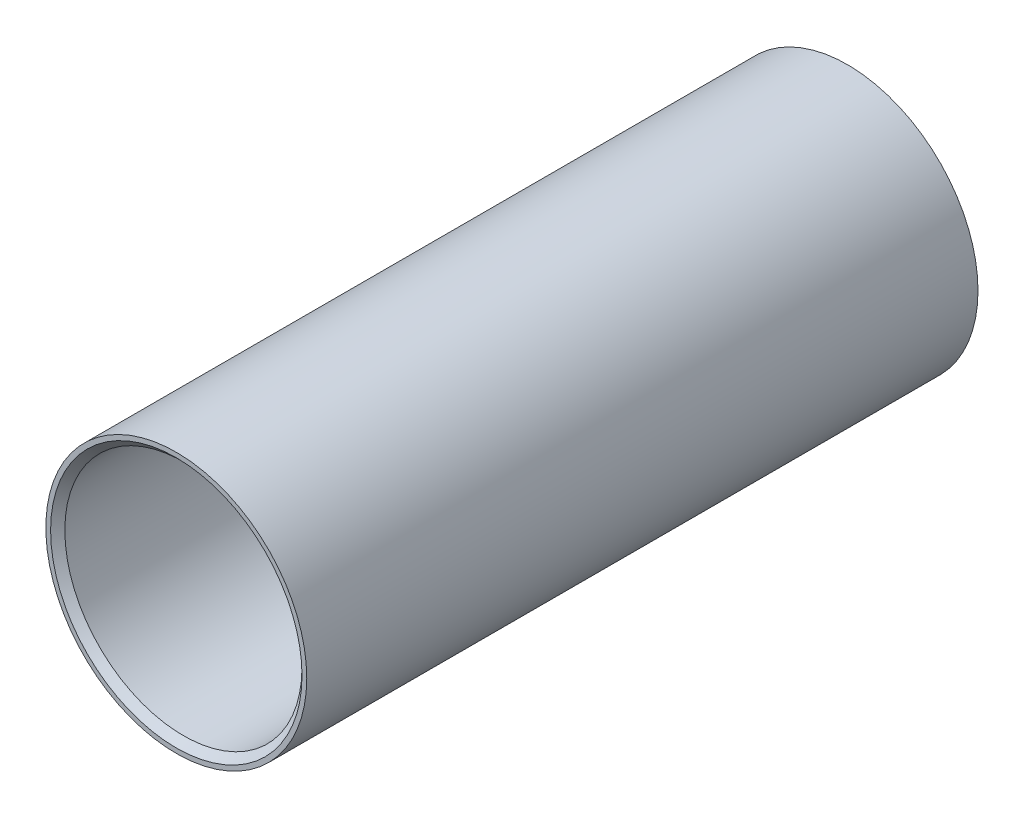
ISO-10303-21;
HEADER;
FILE_DESCRIPTION(('STEP AP214'),'2;1');
FILE_NAME('part.step','',(''),(''),'','','');
FILE_SCHEMA(('AUTOMOTIVE_DESIGN { 1 0 10303 214 1 1 1 1 }'));
ENDSEC;
DATA;
#1=APPLICATION_CONTEXT('core data for automotive mechanical design processes');
#2=APPLICATION_PROTOCOL_DEFINITION('international standard','automotive_design',2000,#1);
#3=PRODUCT_CONTEXT('',#1,'mechanical');
#4=PRODUCT('Part','Part','',(#3));
#5=PRODUCT_RELATED_PRODUCT_CATEGORY('part','',(#4));
#6=PRODUCT_DEFINITION_FORMATION('','',#4);
#7=PRODUCT_DEFINITION_CONTEXT('part definition',#1,'design');
#8=PRODUCT_DEFINITION('design','',#6,#7);
#9=PRODUCT_DEFINITION_SHAPE('','',#8);
#10=(LENGTH_UNIT() NAMED_UNIT(*) SI_UNIT(.MILLI.,.METRE.));
#11=(NAMED_UNIT(*) PLANE_ANGLE_UNIT() SI_UNIT($,.RADIAN.));
#12=(NAMED_UNIT(*) SI_UNIT($,.STERADIAN.) SOLID_ANGLE_UNIT());
#13=UNCERTAINTY_MEASURE_WITH_UNIT(LENGTH_MEASURE(1.E-05),#10,'distance_accuracy_value','');
#14=(GEOMETRIC_REPRESENTATION_CONTEXT(3) GLOBAL_UNCERTAINTY_ASSIGNED_CONTEXT((#13)) GLOBAL_UNIT_ASSIGNED_CONTEXT((#10,
#11,#12)) REPRESENTATION_CONTEXT('',''));
#15=CARTESIAN_POINT('',(0.,0.,0.));
#16=DIRECTION('',(0.,0.,1.));
#17=DIRECTION('',(1.,0.,0.));
#18=AXIS2_PLACEMENT_3D('',#15,#16,#17);
#19=CARTESIAN_POINT('',(0.,5.5,14.15));
#20=DIRECTION('',(0.,0.,-1.));
#21=DIRECTION('',(-1.,0.,0.));
#22=AXIS2_PLACEMENT_3D('',#19,#20,#21);
#23=PLANE('',#22);
#24=CARTESIAN_POINT('',(0.,0.,14.15));
#25=DIRECTION('',(0.,0.,1.));
#26=DIRECTION('',(1.,0.,0.));
#27=AXIS2_PLACEMENT_3D('',#24,#25,#26);
#28=CIRCLE('',#27,5.3);
#29=CARTESIAN_POINT('',(5.3,0.,14.15));
#30=VERTEX_POINT('',#29);
#31=EDGE_CURVE('E10',#30,#30,#28,.T.);
#32=ORIENTED_EDGE('',*,*,#31,.F.);
#33=EDGE_LOOP('',(#32));
#34=FACE_BOUND('',#33,.T.);
#35=CARTESIAN_POINT('',(0.,0.,14.15));
#36=DIRECTION('',(0.,0.,1.));
#37=DIRECTION('',(1.,0.,0.));
#38=AXIS2_PLACEMENT_3D('',#35,#36,#37);
#39=CIRCLE('',#38,5.5);
#40=CARTESIAN_POINT('',(5.5,0.,14.15));
#41=VERTEX_POINT('',#40);
#42=EDGE_CURVE('E53',#41,#41,#39,.T.);
#43=ORIENTED_EDGE('',*,*,#42,.T.);
#44=EDGE_LOOP('',(#43));
#45=FACE_BOUND('',#44,.T.);
#46=ADVANCED_FACE('F31',(#34,#45),#23,.F.);
#47=CARTESIAN_POINT('',(0.,0.,14.15));
#48=DIRECTION('',(0.,0.,1.));
#49=DIRECTION('',(1.,0.,0.));
#50=AXIS2_PLACEMENT_3D('',#47,#48,#49);
#51=CONICAL_SURFACE('',#50,5.3,0.78539816339745);
#52=CARTESIAN_POINT('',(0.,0.,13.85));
#53=DIRECTION('',(0.,0.,1.));
#54=DIRECTION('',(1.,0.,0.));
#55=AXIS2_PLACEMENT_3D('',#52,#53,#54);
#56=CIRCLE('',#55,5.);
#57=CARTESIAN_POINT('',(5.,0.,13.85));
#58=VERTEX_POINT('',#57);
#59=EDGE_CURVE('E37',#58,#58,#56,.T.);
#60=ORIENTED_EDGE('',*,*,#59,.F.);
#61=EDGE_LOOP('',(#60));
#62=FACE_BOUND('',#61,.T.);
#63=ORIENTED_EDGE('',*,*,#31,.T.);
#64=EDGE_LOOP('',(#63));
#65=FACE_BOUND('',#64,.T.);
#66=ADVANCED_FACE('F78',(#62,#65),#51,.F.);
#67=CARTESIAN_POINT('',(0.,0.,0.));
#68=DIRECTION('',(0.,0.,1.));
#69=DIRECTION('',(1.,0.,0.));
#70=AXIS2_PLACEMENT_3D('',#67,#68,#69);
#71=CYLINDRICAL_SURFACE('',#70,5.);
#72=CARTESIAN_POINT('',(0.,0.,-13.85));
#73=DIRECTION('',(0.,0.,1.));
#74=DIRECTION('',(1.,0.,0.));
#75=AXIS2_PLACEMENT_3D('',#72,#73,#74);
#76=CIRCLE('',#75,5.);
#77=CARTESIAN_POINT('',(5.,0.,-13.85));
#78=VERTEX_POINT('',#77);
#79=EDGE_CURVE('E41',#78,#78,#76,.T.);
#80=ORIENTED_EDGE('',*,*,#79,.F.);
#81=EDGE_LOOP('',(#80));
#82=FACE_BOUND('',#81,.T.);
#83=ORIENTED_EDGE('',*,*,#59,.T.);
#84=EDGE_LOOP('',(#83));
#85=FACE_BOUND('',#84,.T.);
#86=ADVANCED_FACE('F73',(#82,#85),#71,.F.);
#87=CARTESIAN_POINT('',(0.,0.,-13.85));
#88=DIRECTION('',(0.,0.,-1.));
#89=DIRECTION('',(-1.,0.,0.));
#90=AXIS2_PLACEMENT_3D('',#87,#88,#89);
#91=CONICAL_SURFACE('',#90,5.,0.785398163397447);
#92=CARTESIAN_POINT('',(0.,0.,-14.15));
#93=DIRECTION('',(0.,0.,1.));
#94=DIRECTION('',(1.,0.,0.));
#95=AXIS2_PLACEMENT_3D('',#92,#93,#94);
#96=CIRCLE('',#95,5.3);
#97=CARTESIAN_POINT('',(5.3,0.,-14.15));
#98=VERTEX_POINT('',#97);
#99=EDGE_CURVE('E45',#98,#98,#96,.T.);
#100=ORIENTED_EDGE('',*,*,#99,.F.);
#101=EDGE_LOOP('',(#100));
#102=FACE_BOUND('',#101,.T.);
#103=ORIENTED_EDGE('',*,*,#79,.T.);
#104=EDGE_LOOP('',(#103));
#105=FACE_BOUND('',#104,.T.);
#106=ADVANCED_FACE('F67',(#102,#105),#91,.F.);
#107=CARTESIAN_POINT('',(0.,5.5,-14.15));
#108=DIRECTION('',(0.,0.,1.));
#109=DIRECTION('',(1.,0.,0.));
#110=AXIS2_PLACEMENT_3D('',#107,#108,#109);
#111=PLANE('',#110);
#112=CARTESIAN_POINT('',(0.,0.,-14.15));
#113=DIRECTION('',(0.,0.,1.));
#114=DIRECTION('',(1.,0.,0.));
#115=AXIS2_PLACEMENT_3D('',#112,#113,#114);
#116=CIRCLE('',#115,5.5);
#117=CARTESIAN_POINT('',(5.5,0.,-14.15));
#118=VERTEX_POINT('',#117);
#119=EDGE_CURVE('E50',#118,#118,#116,.T.);
#120=ORIENTED_EDGE('',*,*,#119,.F.);
#121=EDGE_LOOP('',(#120));
#122=FACE_BOUND('',#121,.T.);
#123=ORIENTED_EDGE('',*,*,#99,.T.);
#124=EDGE_LOOP('',(#123));
#125=FACE_BOUND('',#124,.T.);
#126=ADVANCED_FACE('F61',(#122,#125),#111,.F.);
#127=CARTESIAN_POINT('',(0.,0.,0.));
#128=DIRECTION('',(0.,0.,1.));
#129=DIRECTION('',(1.,0.,0.));
#130=AXIS2_PLACEMENT_3D('',#127,#128,#129);
#131=CYLINDRICAL_SURFACE('',#130,5.5);
#132=ORIENTED_EDGE('',*,*,#42,.F.);
#133=EDGE_LOOP('',(#132));
#134=FACE_BOUND('',#133,.T.);
#135=ORIENTED_EDGE('',*,*,#119,.T.);
#136=EDGE_LOOP('',(#135));
#137=FACE_BOUND('',#136,.T.);
#138=ADVANCED_FACE('F58',(#134,#137),#131,.T.);
#139=CLOSED_SHELL('',(#46,#66,#86,#106,#126,#138));
#140=MANIFOLD_SOLID_BREP('B2',#139);
#141=ADVANCED_BREP_SHAPE_REPRESENTATION('',(#18,#140),#14);
#142=SHAPE_DEFINITION_REPRESENTATION(#9,#141);
ENDSEC;
END-ISO-10303-21;
